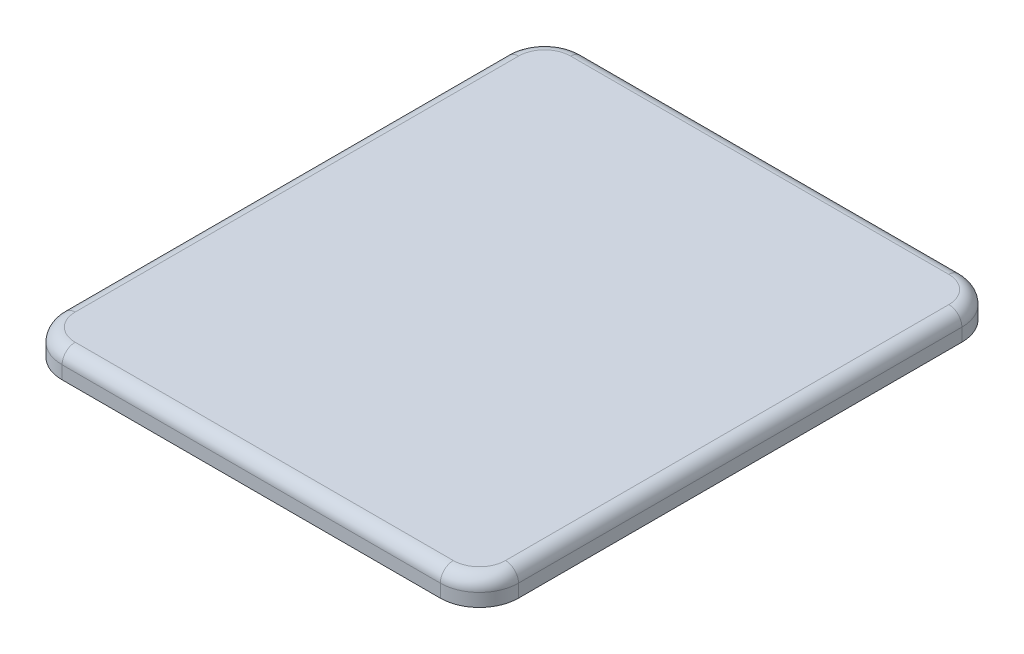
ISO-10303-21;
HEADER;
FILE_DESCRIPTION(('STEP AP214'),'2;1');
FILE_NAME('part.step','',(''),(''),'','','');
FILE_SCHEMA(('AUTOMOTIVE_DESIGN { 1 0 10303 214 1 1 1 1 }'));
ENDSEC;
DATA;
#1=APPLICATION_CONTEXT('core data for automotive mechanical design processes');
#2=APPLICATION_PROTOCOL_DEFINITION('international standard','automotive_design',2000,#1);
#3=PRODUCT_CONTEXT('',#1,'mechanical');
#4=PRODUCT('Part','Part','',(#3));
#5=PRODUCT_RELATED_PRODUCT_CATEGORY('part','',(#4));
#6=PRODUCT_DEFINITION_FORMATION('','',#4);
#7=PRODUCT_DEFINITION_CONTEXT('part definition',#1,'design');
#8=PRODUCT_DEFINITION('design','',#6,#7);
#9=PRODUCT_DEFINITION_SHAPE('','',#8);
#10=(LENGTH_UNIT() NAMED_UNIT(*) SI_UNIT(.MILLI.,.METRE.));
#11=(NAMED_UNIT(*) PLANE_ANGLE_UNIT() SI_UNIT($,.RADIAN.));
#12=(NAMED_UNIT(*) SI_UNIT($,.STERADIAN.) SOLID_ANGLE_UNIT());
#13=UNCERTAINTY_MEASURE_WITH_UNIT(LENGTH_MEASURE(1.E-05),#10,'distance_accuracy_value','');
#14=(GEOMETRIC_REPRESENTATION_CONTEXT(3) GLOBAL_UNCERTAINTY_ASSIGNED_CONTEXT((#13)) GLOBAL_UNIT_ASSIGNED_CONTEXT((#10,
#11,#12)) REPRESENTATION_CONTEXT('',''));
#15=CARTESIAN_POINT('',(0.,0.,0.));
#16=DIRECTION('',(0.,0.,1.));
#17=DIRECTION('',(1.,0.,0.));
#18=AXIS2_PLACEMENT_3D('',#15,#16,#17);
#19=CARTESIAN_POINT('',(-145.,20.,170.));
#20=DIRECTION('',(0.,-1.,0.));
#21=DIRECTION('',(0.,0.,-1.));
#22=AXIS2_PLACEMENT_3D('',#19,#20,#21);
#23=CYLINDRICAL_SURFACE('',#22,30.);
#24=DIRECTION('',(0.,-1.,0.));
#25=VECTOR('',#24,1.);
#26=CARTESIAN_POINT('',(-145.,20.,200.));
#27=LINE('',#26,#25);
#28=CARTESIAN_POINT('',(-145.,10.,200.));
#29=VERTEX_POINT('',#28);
#30=CARTESIAN_POINT('',(-145.,0.,200.));
#31=VERTEX_POINT('',#30);
#32=EDGE_CURVE('E127',#29,#31,#27,.T.);
#33=ORIENTED_EDGE('',*,*,#32,.F.);
#34=CARTESIAN_POINT('',(-145.,10.,170.));
#35=DIRECTION('',(0.,1.,0.));
#36=DIRECTION('',(0.,0.,1.));
#37=AXIS2_PLACEMENT_3D('',#34,#35,#36);
#38=CIRCLE('',#37,30.);
#39=CARTESIAN_POINT('',(-175.,10.,170.));
#40=VERTEX_POINT('',#39);
#41=EDGE_CURVE('E11',#29,#40,#38,.F.);
#42=ORIENTED_EDGE('',*,*,#41,.T.);
#43=DIRECTION('',(0.,-1.,0.));
#44=VECTOR('',#43,1.);
#45=CARTESIAN_POINT('',(-175.,20.,170.));
#46=LINE('',#45,#44);
#47=CARTESIAN_POINT('',(-175.,0.,170.));
#48=VERTEX_POINT('',#47);
#49=EDGE_CURVE('E148',#40,#48,#46,.T.);
#50=ORIENTED_EDGE('',*,*,#49,.T.);
#51=CARTESIAN_POINT('',(-145.,0.,170.));
#52=DIRECTION('',(0.,1.,0.));
#53=DIRECTION('',(0.,0.,1.));
#54=AXIS2_PLACEMENT_3D('',#51,#52,#53);
#55=CIRCLE('',#54,30.);
#56=EDGE_CURVE('E142',#48,#31,#55,.T.);
#57=ORIENTED_EDGE('',*,*,#56,.T.);
#58=EDGE_LOOP('',(#33,#42,#50,#57));
#59=FACE_BOUND('',#58,.T.);
#60=ADVANCED_FACE('F39',(#59),#23,.T.);
#61=CARTESIAN_POINT('',(-145.,20.,200.));
#62=DIRECTION('',(0.,0.,-1.));
#63=DIRECTION('',(-1.,0.,0.));
#64=AXIS2_PLACEMENT_3D('',#61,#62,#63);
#65=PLANE('',#64);
#66=DIRECTION('',(0.,-1.,0.));
#67=VECTOR('',#66,1.);
#68=CARTESIAN_POINT('',(145.,20.,200.));
#69=LINE('',#68,#67);
#70=CARTESIAN_POINT('',(145.,10.,200.));
#71=VERTEX_POINT('',#70);
#72=CARTESIAN_POINT('',(145.,0.,200.));
#73=VERTEX_POINT('',#72);
#74=EDGE_CURVE('E136',#71,#73,#69,.T.);
#75=ORIENTED_EDGE('',*,*,#74,.F.);
#76=DIRECTION('',(1.,0.,0.));
#77=VECTOR('',#76,1.);
#78=CARTESIAN_POINT('',(-145.,10.,200.));
#79=LINE('',#78,#77);
#80=EDGE_CURVE('E48',#71,#29,#79,.F.);
#81=ORIENTED_EDGE('',*,*,#80,.T.);
#82=ORIENTED_EDGE('',*,*,#32,.T.);
#83=DIRECTION('',(1.,0.,0.));
#84=VECTOR('',#83,1.);
#85=CARTESIAN_POINT('',(-145.,0.,200.));
#86=LINE('',#85,#84);
#87=EDGE_CURVE('E130',#31,#73,#86,.T.);
#88=ORIENTED_EDGE('',*,*,#87,.T.);
#89=EDGE_LOOP('',(#75,#81,#82,#88));
#90=FACE_BOUND('',#89,.T.);
#91=ADVANCED_FACE('F129',(#90),#65,.F.);
#92=CARTESIAN_POINT('',(145.,20.,170.));
#93=DIRECTION('',(0.,-1.,0.));
#94=DIRECTION('',(0.,0.,-1.));
#95=AXIS2_PLACEMENT_3D('',#92,#93,#94);
#96=CYLINDRICAL_SURFACE('',#95,30.);
#97=DIRECTION('',(0.,-1.,0.));
#98=VECTOR('',#97,1.);
#99=CARTESIAN_POINT('',(175.,20.,170.));
#100=LINE('',#99,#98);
#101=CARTESIAN_POINT('',(175.,10.,170.));
#102=VERTEX_POINT('',#101);
#103=CARTESIAN_POINT('',(175.,0.,170.));
#104=VERTEX_POINT('',#103);
#105=EDGE_CURVE('E178',#102,#104,#100,.T.);
#106=ORIENTED_EDGE('',*,*,#105,.F.);
#107=CARTESIAN_POINT('',(145.,10.,170.));
#108=DIRECTION('',(0.,1.,0.));
#109=DIRECTION('',(0.,0.,1.));
#110=AXIS2_PLACEMENT_3D('',#107,#108,#109);
#111=CIRCLE('',#110,30.);
#112=EDGE_CURVE('E63',#102,#71,#111,.F.);
#113=ORIENTED_EDGE('',*,*,#112,.T.);
#114=ORIENTED_EDGE('',*,*,#74,.T.);
#115=CARTESIAN_POINT('',(145.,0.,170.));
#116=DIRECTION('',(0.,1.,0.));
#117=DIRECTION('',(0.,0.,1.));
#118=AXIS2_PLACEMENT_3D('',#115,#116,#117);
#119=CIRCLE('',#118,30.);
#120=EDGE_CURVE('E145',#73,#104,#119,.T.);
#121=ORIENTED_EDGE('',*,*,#120,.T.);
#122=EDGE_LOOP('',(#106,#113,#114,#121));
#123=FACE_BOUND('',#122,.T.);
#124=ADVANCED_FACE('F281',(#123),#96,.T.);
#125=CARTESIAN_POINT('',(175.,20.,170.));
#126=DIRECTION('',(-1.,0.,0.));
#127=DIRECTION('',(0.,0.,1.));
#128=AXIS2_PLACEMENT_3D('',#125,#126,#127);
#129=PLANE('',#128);
#130=DIRECTION('',(0.,-1.,0.));
#131=VECTOR('',#130,1.);
#132=CARTESIAN_POINT('',(175.,20.,-170.));
#133=LINE('',#132,#131);
#134=CARTESIAN_POINT('',(175.,10.,-170.));
#135=VERTEX_POINT('',#134);
#136=CARTESIAN_POINT('',(175.,0.,-170.));
#137=VERTEX_POINT('',#136);
#138=EDGE_CURVE('E176',#135,#137,#133,.T.);
#139=ORIENTED_EDGE('',*,*,#138,.F.);
#140=DIRECTION('',(0.,0.,-1.));
#141=VECTOR('',#140,1.);
#142=CARTESIAN_POINT('',(175.,10.,170.));
#143=LINE('',#142,#141);
#144=EDGE_CURVE('E206',#135,#102,#143,.F.);
#145=ORIENTED_EDGE('',*,*,#144,.T.);
#146=ORIENTED_EDGE('',*,*,#105,.T.);
#147=DIRECTION('',(0.,0.,-1.));
#148=VECTOR('',#147,1.);
#149=CARTESIAN_POINT('',(175.,0.,170.));
#150=LINE('',#149,#148);
#151=EDGE_CURVE('E155',#104,#137,#150,.T.);
#152=ORIENTED_EDGE('',*,*,#151,.T.);
#153=EDGE_LOOP('',(#139,#145,#146,#152));
#154=FACE_BOUND('',#153,.T.);
#155=ADVANCED_FACE('F279',(#154),#129,.F.);
#156=CARTESIAN_POINT('',(145.,20.,-170.));
#157=DIRECTION('',(0.,-1.,0.));
#158=DIRECTION('',(0.,0.,-1.));
#159=AXIS2_PLACEMENT_3D('',#156,#157,#158);
#160=CYLINDRICAL_SURFACE('',#159,30.);
#161=DIRECTION('',(0.,-1.,0.));
#162=VECTOR('',#161,1.);
#163=CARTESIAN_POINT('',(145.,20.,-200.));
#164=LINE('',#163,#162);
#165=CARTESIAN_POINT('',(145.,10.,-200.));
#166=VERTEX_POINT('',#165);
#167=CARTESIAN_POINT('',(145.,0.,-200.));
#168=VERTEX_POINT('',#167);
#169=EDGE_CURVE('E174',#166,#168,#164,.T.);
#170=ORIENTED_EDGE('',*,*,#169,.F.);
#171=CARTESIAN_POINT('',(145.,10.,-170.));
#172=DIRECTION('',(0.,1.,0.));
#173=DIRECTION('',(0.,0.,1.));
#174=AXIS2_PLACEMENT_3D('',#171,#172,#173);
#175=CIRCLE('',#174,30.);
#176=EDGE_CURVE('E204',#166,#135,#175,.F.);
#177=ORIENTED_EDGE('',*,*,#176,.T.);
#178=ORIENTED_EDGE('',*,*,#138,.T.);
#179=CARTESIAN_POINT('',(145.,0.,-170.));
#180=DIRECTION('',(0.,1.,0.));
#181=DIRECTION('',(0.,0.,1.));
#182=AXIS2_PLACEMENT_3D('',#179,#180,#181);
#183=CIRCLE('',#182,30.);
#184=EDGE_CURVE('E158',#137,#168,#183,.T.);
#185=ORIENTED_EDGE('',*,*,#184,.T.);
#186=EDGE_LOOP('',(#170,#177,#178,#185));
#187=FACE_BOUND('',#186,.T.);
#188=ADVANCED_FACE('F277',(#187),#160,.T.);
#189=CARTESIAN_POINT('',(-145.,20.,-200.));
#190=DIRECTION('',(0.,0.,1.));
#191=DIRECTION('',(1.,0.,0.));
#192=AXIS2_PLACEMENT_3D('',#189,#190,#191);
#193=PLANE('',#192);
#194=DIRECTION('',(0.,-1.,0.));
#195=VECTOR('',#194,1.);
#196=CARTESIAN_POINT('',(-145.,20.,-200.));
#197=LINE('',#196,#195);
#198=CARTESIAN_POINT('',(-145.,10.,-200.));
#199=VERTEX_POINT('',#198);
#200=CARTESIAN_POINT('',(-145.,0.,-200.));
#201=VERTEX_POINT('',#200);
#202=EDGE_CURVE('E172',#199,#201,#197,.T.);
#203=ORIENTED_EDGE('',*,*,#202,.F.);
#204=DIRECTION('',(-1.,0.,0.));
#205=VECTOR('',#204,1.);
#206=CARTESIAN_POINT('',(145.,10.,-200.));
#207=LINE('',#206,#205);
#208=EDGE_CURVE('E202',#199,#166,#207,.F.);
#209=ORIENTED_EDGE('',*,*,#208,.T.);
#210=ORIENTED_EDGE('',*,*,#169,.T.);
#211=DIRECTION('',(-1.,0.,0.));
#212=VECTOR('',#211,1.);
#213=CARTESIAN_POINT('',(-145.,0.,-200.));
#214=LINE('',#213,#212);
#215=EDGE_CURVE('E161',#168,#201,#214,.T.);
#216=ORIENTED_EDGE('',*,*,#215,.T.);
#217=EDGE_LOOP('',(#203,#209,#210,#216));
#218=FACE_BOUND('',#217,.T.);
#219=ADVANCED_FACE('F265',(#218),#193,.F.);
#220=CARTESIAN_POINT('',(-145.,20.,-170.));
#221=DIRECTION('',(0.,-1.,0.));
#222=DIRECTION('',(0.,0.,-1.));
#223=AXIS2_PLACEMENT_3D('',#220,#221,#222);
#224=CYLINDRICAL_SURFACE('',#223,30.);
#225=DIRECTION('',(0.,-1.,0.));
#226=VECTOR('',#225,1.);
#227=CARTESIAN_POINT('',(-175.,20.,-170.));
#228=LINE('',#227,#226);
#229=CARTESIAN_POINT('',(-175.,10.,-170.));
#230=VERTEX_POINT('',#229);
#231=CARTESIAN_POINT('',(-175.,0.,-170.));
#232=VERTEX_POINT('',#231);
#233=EDGE_CURVE('E170',#230,#232,#228,.T.);
#234=ORIENTED_EDGE('',*,*,#233,.F.);
#235=CARTESIAN_POINT('',(-145.,10.,-170.));
#236=DIRECTION('',(0.,1.,0.));
#237=DIRECTION('',(0.,0.,1.));
#238=AXIS2_PLACEMENT_3D('',#235,#236,#237);
#239=CIRCLE('',#238,30.);
#240=EDGE_CURVE('E200',#230,#199,#239,.F.);
#241=ORIENTED_EDGE('',*,*,#240,.T.);
#242=ORIENTED_EDGE('',*,*,#202,.T.);
#243=CARTESIAN_POINT('',(-145.,0.,-170.));
#244=DIRECTION('',(0.,1.,0.));
#245=DIRECTION('',(0.,0.,1.));
#246=AXIS2_PLACEMENT_3D('',#243,#244,#245);
#247=CIRCLE('',#246,30.);
#248=EDGE_CURVE('E164',#201,#232,#247,.T.);
#249=ORIENTED_EDGE('',*,*,#248,.T.);
#250=EDGE_LOOP('',(#234,#241,#242,#249));
#251=FACE_BOUND('',#250,.T.);
#252=ADVANCED_FACE('F262',(#251),#224,.T.);
#253=CARTESIAN_POINT('',(-175.,20.,170.));
#254=DIRECTION('',(1.,0.,0.));
#255=DIRECTION('',(0.,0.,-1.));
#256=AXIS2_PLACEMENT_3D('',#253,#254,#255);
#257=PLANE('',#256);
#258=ORIENTED_EDGE('',*,*,#49,.F.);
#259=DIRECTION('',(0.,0.,1.));
#260=VECTOR('',#259,1.);
#261=CARTESIAN_POINT('',(-175.,10.,-170.));
#262=LINE('',#261,#260);
#263=EDGE_CURVE('E197',#40,#230,#262,.F.);
#264=ORIENTED_EDGE('',*,*,#263,.T.);
#265=ORIENTED_EDGE('',*,*,#233,.T.);
#266=DIRECTION('',(0.,0.,1.));
#267=VECTOR('',#266,1.);
#268=CARTESIAN_POINT('',(-175.,0.,170.));
#269=LINE('',#268,#267);
#270=EDGE_CURVE('E167',#232,#48,#269,.T.);
#271=ORIENTED_EDGE('',*,*,#270,.T.);
#272=EDGE_LOOP('',(#258,#264,#265,#271));
#273=FACE_BOUND('',#272,.T.);
#274=ADVANCED_FACE('F249',(#273),#257,.F.);
#275=CARTESIAN_POINT('',(-145.,20.,170.));
#276=DIRECTION('',(0.,1.,0.));
#277=DIRECTION('',(0.,0.,1.));
#278=AXIS2_PLACEMENT_3D('',#275,#276,#277);
#279=PLANE('',#278);
#280=CARTESIAN_POINT('',(-145.,20.,-170.));
#281=DIRECTION('',(0.,1.,0.));
#282=DIRECTION('',(0.,0.,1.));
#283=AXIS2_PLACEMENT_3D('',#280,#281,#282);
#284=CIRCLE('',#283,20.);
#285=CARTESIAN_POINT('',(-145.,20.,-190.));
#286=VERTEX_POINT('',#285);
#287=CARTESIAN_POINT('',(-165.,20.,-170.));
#288=VERTEX_POINT('',#287);
#289=EDGE_CURVE('E192',#286,#288,#284,.T.);
#290=ORIENTED_EDGE('',*,*,#289,.T.);
#291=DIRECTION('',(0.,0.,1.));
#292=VECTOR('',#291,1.);
#293=CARTESIAN_POINT('',(-165.,20.,170.));
#294=LINE('',#293,#292);
#295=CARTESIAN_POINT('',(-165.,20.,170.));
#296=VERTEX_POINT('',#295);
#297=EDGE_CURVE('E194',#288,#296,#294,.T.);
#298=ORIENTED_EDGE('',*,*,#297,.T.);
#299=CARTESIAN_POINT('',(-145.,20.,170.));
#300=DIRECTION('',(0.,1.,0.));
#301=DIRECTION('',(0.,0.,1.));
#302=AXIS2_PLACEMENT_3D('',#299,#300,#301);
#303=CIRCLE('',#302,20.);
#304=CARTESIAN_POINT('',(-145.,20.,190.));
#305=VERTEX_POINT('',#304);
#306=EDGE_CURVE('E135',#296,#305,#303,.T.);
#307=ORIENTED_EDGE('',*,*,#306,.T.);
#308=DIRECTION('',(1.,0.,0.));
#309=VECTOR('',#308,1.);
#310=CARTESIAN_POINT('',(145.,20.,190.));
#311=LINE('',#310,#309);
#312=CARTESIAN_POINT('',(145.,20.,190.));
#313=VERTEX_POINT('',#312);
#314=EDGE_CURVE('E182',#305,#313,#311,.T.);
#315=ORIENTED_EDGE('',*,*,#314,.T.);
#316=CARTESIAN_POINT('',(145.,20.,170.));
#317=DIRECTION('',(0.,1.,0.));
#318=DIRECTION('',(0.,0.,1.));
#319=AXIS2_PLACEMENT_3D('',#316,#317,#318);
#320=CIRCLE('',#319,20.);
#321=CARTESIAN_POINT('',(165.,20.,170.));
#322=VERTEX_POINT('',#321);
#323=EDGE_CURVE('E184',#313,#322,#320,.T.);
#324=ORIENTED_EDGE('',*,*,#323,.T.);
#325=DIRECTION('',(0.,0.,-1.));
#326=VECTOR('',#325,1.);
#327=CARTESIAN_POINT('',(165.,20.,-170.));
#328=LINE('',#327,#326);
#329=CARTESIAN_POINT('',(165.,20.,-170.));
#330=VERTEX_POINT('',#329);
#331=EDGE_CURVE('E186',#322,#330,#328,.T.);
#332=ORIENTED_EDGE('',*,*,#331,.T.);
#333=CARTESIAN_POINT('',(145.,20.,-170.));
#334=DIRECTION('',(0.,1.,0.));
#335=DIRECTION('',(0.,0.,1.));
#336=AXIS2_PLACEMENT_3D('',#333,#334,#335);
#337=CIRCLE('',#336,20.);
#338=CARTESIAN_POINT('',(145.,20.,-190.));
#339=VERTEX_POINT('',#338);
#340=EDGE_CURVE('E188',#330,#339,#337,.T.);
#341=ORIENTED_EDGE('',*,*,#340,.T.);
#342=DIRECTION('',(-1.,0.,0.));
#343=VECTOR('',#342,1.);
#344=CARTESIAN_POINT('',(-145.,20.,-190.));
#345=LINE('',#344,#343);
#346=EDGE_CURVE('E190',#339,#286,#345,.T.);
#347=ORIENTED_EDGE('',*,*,#346,.T.);
#348=EDGE_LOOP('',(#290,#298,#307,#315,#324,#332,#341,#347));
#349=FACE_BOUND('',#348,.T.);
#350=ADVANCED_FACE('F237',(#349),#279,.T.);
#351=CARTESIAN_POINT('',(-145.,0.,170.));
#352=DIRECTION('',(0.,1.,0.));
#353=DIRECTION('',(0.,0.,1.));
#354=AXIS2_PLACEMENT_3D('',#351,#352,#353);
#355=PLANE('',#354);
#356=ORIENTED_EDGE('',*,*,#56,.F.);
#357=ORIENTED_EDGE('',*,*,#270,.F.);
#358=ORIENTED_EDGE('',*,*,#248,.F.);
#359=ORIENTED_EDGE('',*,*,#215,.F.);
#360=ORIENTED_EDGE('',*,*,#184,.F.);
#361=ORIENTED_EDGE('',*,*,#151,.F.);
#362=ORIENTED_EDGE('',*,*,#120,.F.);
#363=ORIENTED_EDGE('',*,*,#87,.F.);
#364=EDGE_LOOP('',(#356,#357,#358,#359,#360,#361,#362,#363));
#365=FACE_BOUND('',#364,.T.);
#366=ADVANCED_FACE('F140',(#365),#355,.F.);
#367=CARTESIAN_POINT('',(165.,10.,170.));
#368=DIRECTION('',(0.,0.,1.));
#369=DIRECTION('',(1.,0.,0.));
#370=AXIS2_PLACEMENT_3D('',#367,#368,#369);
#371=CYLINDRICAL_SURFACE('',#370,10.);
#372=CARTESIAN_POINT('',(165.,10.,170.));
#373=DIRECTION('',(0.,0.,1.));
#374=DIRECTION('',(1.,0.,0.));
#375=AXIS2_PLACEMENT_3D('',#372,#373,#374);
#376=CIRCLE('',#375,10.);
#377=EDGE_CURVE('E152',#102,#322,#376,.T.);
#378=ORIENTED_EDGE('',*,*,#377,.F.);
#379=ORIENTED_EDGE('',*,*,#144,.F.);
#380=CARTESIAN_POINT('',(165.,10.,-170.));
#381=DIRECTION('',(0.,0.,-1.));
#382=DIRECTION('',(-1.,0.,0.));
#383=AXIS2_PLACEMENT_3D('',#380,#381,#382);
#384=CIRCLE('',#383,10.);
#385=EDGE_CURVE('E43',#330,#135,#384,.T.);
#386=ORIENTED_EDGE('',*,*,#385,.F.);
#387=ORIENTED_EDGE('',*,*,#331,.F.);
#388=EDGE_LOOP('',(#378,#379,#386,#387));
#389=FACE_BOUND('',#388,.T.);
#390=ADVANCED_FACE('F41',(#389),#371,.T.);
#391=CARTESIAN_POINT('',(145.,10.,-170.));
#392=DIRECTION('',(0.,1.,0.));
#393=DIRECTION('',(0.,0.,1.));
#394=AXIS2_PLACEMENT_3D('',#391,#392,#393);
#395=TOROIDAL_SURFACE('',#394,20.,10.);
#396=ORIENTED_EDGE('',*,*,#385,.T.);
#397=ORIENTED_EDGE('',*,*,#176,.F.);
#398=CARTESIAN_POINT('',(145.,10.,-190.));
#399=DIRECTION('',(-1.,0.,0.));
#400=DIRECTION('',(0.,0.,1.));
#401=AXIS2_PLACEMENT_3D('',#398,#399,#400);
#402=CIRCLE('',#401,10.);
#403=EDGE_CURVE('E223',#339,#166,#402,.T.);
#404=ORIENTED_EDGE('',*,*,#403,.F.);
#405=ORIENTED_EDGE('',*,*,#340,.F.);
#406=EDGE_LOOP('',(#396,#397,#404,#405));
#407=FACE_BOUND('',#406,.T.);
#408=ADVANCED_FACE('F274',(#407),#395,.T.);
#409=CARTESIAN_POINT('',(145.,10.,170.));
#410=DIRECTION('',(0.,1.,0.));
#411=DIRECTION('',(0.,0.,1.));
#412=AXIS2_PLACEMENT_3D('',#409,#410,#411);
#413=TOROIDAL_SURFACE('',#412,20.,10.);
#414=ORIENTED_EDGE('',*,*,#377,.T.);
#415=ORIENTED_EDGE('',*,*,#323,.F.);
#416=CARTESIAN_POINT('',(145.,10.,190.));
#417=DIRECTION('',(-1.,0.,0.));
#418=DIRECTION('',(0.,0.,1.));
#419=AXIS2_PLACEMENT_3D('',#416,#417,#418);
#420=CIRCLE('',#419,10.);
#421=EDGE_CURVE('E220',#71,#313,#420,.T.);
#422=ORIENTED_EDGE('',*,*,#421,.F.);
#423=ORIENTED_EDGE('',*,*,#112,.F.);
#424=EDGE_LOOP('',(#414,#415,#422,#423));
#425=FACE_BOUND('',#424,.T.);
#426=ADVANCED_FACE('F229',(#425),#413,.T.);
#427=CARTESIAN_POINT('',(-145.,10.,-190.));
#428=DIRECTION('',(1.,0.,0.));
#429=DIRECTION('',(0.,0.,-1.));
#430=AXIS2_PLACEMENT_3D('',#427,#428,#429);
#431=CYLINDRICAL_SURFACE('',#430,10.);
#432=ORIENTED_EDGE('',*,*,#403,.T.);
#433=ORIENTED_EDGE('',*,*,#208,.F.);
#434=CARTESIAN_POINT('',(-145.,10.,-190.));
#435=DIRECTION('',(-1.,0.,0.));
#436=DIRECTION('',(0.,0.,1.));
#437=AXIS2_PLACEMENT_3D('',#434,#435,#436);
#438=CIRCLE('',#437,10.);
#439=EDGE_CURVE('E217',#286,#199,#438,.T.);
#440=ORIENTED_EDGE('',*,*,#439,.F.);
#441=ORIENTED_EDGE('',*,*,#346,.F.);
#442=EDGE_LOOP('',(#432,#433,#440,#441));
#443=FACE_BOUND('',#442,.T.);
#444=ADVANCED_FACE('F270',(#443),#431,.T.);
#445=CARTESIAN_POINT('',(-145.,10.,190.));
#446=DIRECTION('',(-1.,0.,0.));
#447=DIRECTION('',(0.,0.,1.));
#448=AXIS2_PLACEMENT_3D('',#445,#446,#447);
#449=CYLINDRICAL_SURFACE('',#448,10.);
#450=ORIENTED_EDGE('',*,*,#421,.T.);
#451=ORIENTED_EDGE('',*,*,#314,.F.);
#452=CARTESIAN_POINT('',(-145.,10.,190.));
#453=DIRECTION('',(-1.,0.,0.));
#454=DIRECTION('',(0.,0.,1.));
#455=AXIS2_PLACEMENT_3D('',#452,#453,#454);
#456=CIRCLE('',#455,10.);
#457=EDGE_CURVE('E214',#29,#305,#456,.T.);
#458=ORIENTED_EDGE('',*,*,#457,.F.);
#459=ORIENTED_EDGE('',*,*,#80,.F.);
#460=EDGE_LOOP('',(#450,#451,#458,#459));
#461=FACE_BOUND('',#460,.T.);
#462=ADVANCED_FACE('F242',(#461),#449,.T.);
#463=CARTESIAN_POINT('',(-145.,10.,-170.));
#464=DIRECTION('',(0.,1.,0.));
#465=DIRECTION('',(0.,0.,1.));
#466=AXIS2_PLACEMENT_3D('',#463,#464,#465);
#467=TOROIDAL_SURFACE('',#466,20.,10.);
#468=ORIENTED_EDGE('',*,*,#439,.T.);
#469=ORIENTED_EDGE('',*,*,#240,.F.);
#470=CARTESIAN_POINT('',(-165.,10.,-170.));
#471=DIRECTION('',(0.,0.,1.));
#472=DIRECTION('',(1.,0.,0.));
#473=AXIS2_PLACEMENT_3D('',#470,#471,#472);
#474=CIRCLE('',#473,10.);
#475=EDGE_CURVE('E212',#288,#230,#474,.T.);
#476=ORIENTED_EDGE('',*,*,#475,.F.);
#477=ORIENTED_EDGE('',*,*,#289,.F.);
#478=EDGE_LOOP('',(#468,#469,#476,#477));
#479=FACE_BOUND('',#478,.T.);
#480=ADVANCED_FACE('F258',(#479),#467,.T.);
#481=CARTESIAN_POINT('',(-145.,10.,170.));
#482=DIRECTION('',(0.,1.,0.));
#483=DIRECTION('',(0.,0.,1.));
#484=AXIS2_PLACEMENT_3D('',#481,#482,#483);
#485=TOROIDAL_SURFACE('',#484,20.,10.);
#486=ORIENTED_EDGE('',*,*,#457,.T.);
#487=ORIENTED_EDGE('',*,*,#306,.F.);
#488=CARTESIAN_POINT('',(-165.,10.,170.));
#489=DIRECTION('',(0.,0.,-1.));
#490=DIRECTION('',(0.,1.,0.));
#491=AXIS2_PLACEMENT_3D('',#488,#489,#490);
#492=CIRCLE('',#491,10.);
#493=EDGE_CURVE('E210',#40,#296,#492,.T.);
#494=ORIENTED_EDGE('',*,*,#493,.F.);
#495=ORIENTED_EDGE('',*,*,#41,.F.);
#496=EDGE_LOOP('',(#486,#487,#494,#495));
#497=FACE_BOUND('',#496,.T.);
#498=ADVANCED_FACE('F245',(#497),#485,.T.);
#499=CARTESIAN_POINT('',(-165.,10.,170.));
#500=DIRECTION('',(0.,0.,-1.));
#501=DIRECTION('',(-1.,0.,0.));
#502=AXIS2_PLACEMENT_3D('',#499,#500,#501);
#503=CYLINDRICAL_SURFACE('',#502,10.);
#504=ORIENTED_EDGE('',*,*,#475,.T.);
#505=ORIENTED_EDGE('',*,*,#263,.F.);
#506=ORIENTED_EDGE('',*,*,#493,.T.);
#507=ORIENTED_EDGE('',*,*,#297,.F.);
#508=EDGE_LOOP('',(#504,#505,#506,#507));
#509=FACE_BOUND('',#508,.T.);
#510=ADVANCED_FACE('F252',(#509),#503,.T.);
#511=CLOSED_SHELL('',(#60,#91,#124,#155,#188,#219,#252,#274,#350,#366,#390,#408,#426,#444,#462,
#480,#498,#510));
#512=MANIFOLD_SOLID_BREP('B2',#511);
#513=ADVANCED_BREP_SHAPE_REPRESENTATION('',(#18,#512),#14);
#514=SHAPE_DEFINITION_REPRESENTATION(#9,#513);
ENDSEC;
END-ISO-10303-21;
